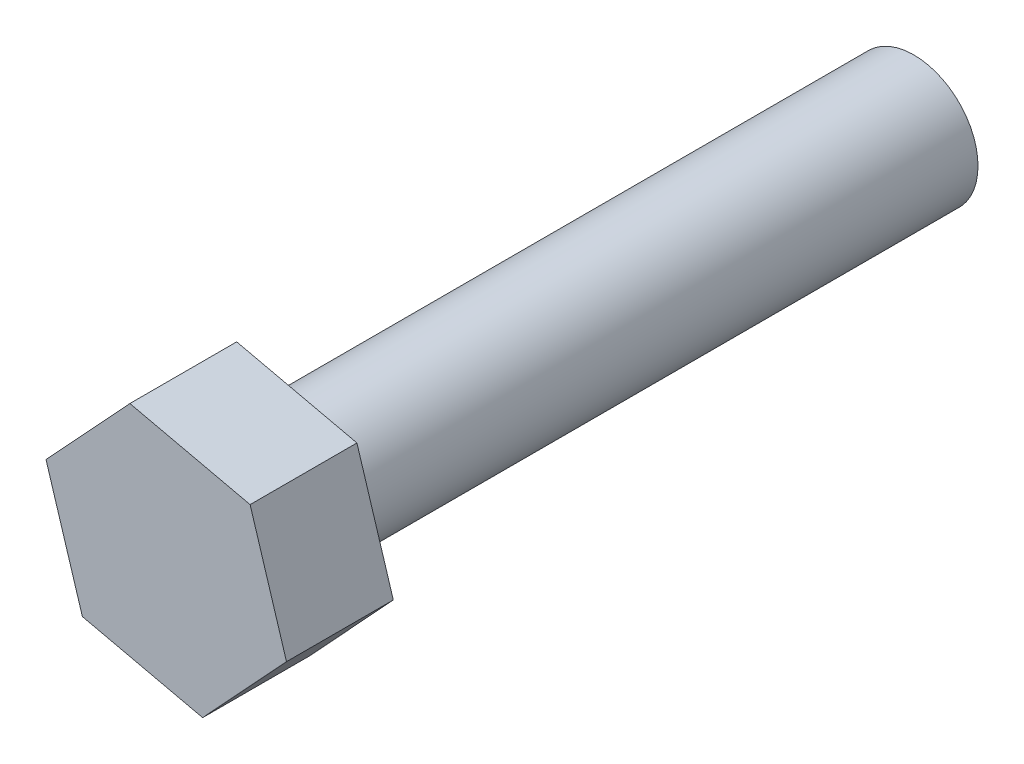
ISO-10303-21;
HEADER;
FILE_DESCRIPTION(('STEP AP214'),'2;1');
FILE_NAME('part.step','',(''),(''),'','','');
FILE_SCHEMA(('AUTOMOTIVE_DESIGN { 1 0 10303 214 1 1 1 1 }'));
ENDSEC;
DATA;
#1=APPLICATION_CONTEXT('core data for automotive mechanical design processes');
#2=APPLICATION_PROTOCOL_DEFINITION('international standard','automotive_design',2000,#1);
#3=PRODUCT_CONTEXT('',#1,'mechanical');
#4=PRODUCT('Part','Part','',(#3));
#5=PRODUCT_RELATED_PRODUCT_CATEGORY('part','',(#4));
#6=PRODUCT_DEFINITION_FORMATION('','',#4);
#7=PRODUCT_DEFINITION_CONTEXT('part definition',#1,'design');
#8=PRODUCT_DEFINITION('design','',#6,#7);
#9=PRODUCT_DEFINITION_SHAPE('','',#8);
#10=(LENGTH_UNIT() NAMED_UNIT(*) SI_UNIT(.MILLI.,.METRE.));
#11=(NAMED_UNIT(*) PLANE_ANGLE_UNIT() SI_UNIT($,.RADIAN.));
#12=(NAMED_UNIT(*) SI_UNIT($,.STERADIAN.) SOLID_ANGLE_UNIT());
#13=UNCERTAINTY_MEASURE_WITH_UNIT(LENGTH_MEASURE(1.E-05),#10,'distance_accuracy_value','');
#14=(GEOMETRIC_REPRESENTATION_CONTEXT(3) GLOBAL_UNCERTAINTY_ASSIGNED_CONTEXT((#13)) GLOBAL_UNIT_ASSIGNED_CONTEXT((#10,
#11,#12)) REPRESENTATION_CONTEXT('',''));
#15=CARTESIAN_POINT('',(0.,0.,0.));
#16=DIRECTION('',(0.,0.,1.));
#17=DIRECTION('',(1.,0.,0.));
#18=AXIS2_PLACEMENT_3D('',#15,#16,#17);
#19=CARTESIAN_POINT('',(0.,0.,30.));
#20=DIRECTION('',(0.,0.,-1.));
#21=DIRECTION('',(-1.,0.,0.));
#22=AXIS2_PLACEMENT_3D('',#19,#20,#21);
#23=CYLINDRICAL_SURFACE('',#22,3.);
#24=CARTESIAN_POINT('',(0.,0.,30.));
#25=DIRECTION('',(0.,0.,1.));
#26=DIRECTION('',(1.,0.,0.));
#27=AXIS2_PLACEMENT_3D('',#24,#25,#26);
#28=CIRCLE('',#27,3.);
#29=CARTESIAN_POINT('',(3.,0.,30.));
#30=VERTEX_POINT('',#29);
#31=EDGE_CURVE('E11',#30,#30,#28,.T.);
#32=ORIENTED_EDGE('',*,*,#31,.F.);
#33=EDGE_LOOP('',(#32));
#34=FACE_BOUND('',#33,.T.);
#35=CARTESIAN_POINT('',(0.,0.,0.));
#36=DIRECTION('',(0.,0.,1.));
#37=DIRECTION('',(1.,0.,0.));
#38=AXIS2_PLACEMENT_3D('',#35,#36,#37);
#39=CIRCLE('',#38,3.);
#40=CARTESIAN_POINT('',(3.,0.,0.));
#41=VERTEX_POINT('',#40);
#42=EDGE_CURVE('E42',#41,#41,#39,.T.);
#43=ORIENTED_EDGE('',*,*,#42,.T.);
#44=EDGE_LOOP('',(#43));
#45=FACE_BOUND('',#44,.T.);
#46=ADVANCED_FACE('F39',(#34,#45),#23,.T.);
#47=CARTESIAN_POINT('',(0.,0.,0.));
#48=DIRECTION('',(0.,0.,1.));
#49=DIRECTION('',(1.,0.,0.));
#50=AXIS2_PLACEMENT_3D('',#47,#48,#49);
#51=PLANE('',#50);
#52=ORIENTED_EDGE('',*,*,#42,.F.);
#53=EDGE_LOOP('',(#52));
#54=FACE_BOUND('',#53,.T.);
#55=ADVANCED_FACE('F164',(#54),#51,.F.);
#56=CARTESIAN_POINT('',(5.62906469185798,-1.28334096334963,35.));
#57=DIRECTION('',(-0.955500291376495,-0.294990157767058,0.));
#58=DIRECTION('',(0.294990157767058,-0.955500291376495,0.));
#59=AXIS2_PLACEMENT_3D('',#56,#57,#58);
#60=PLANE('',#59);
#61=DIRECTION('',(-0.294990157767058,0.955500291376495,0.));
#62=VECTOR('',#61,1.);
#63=CARTESIAN_POINT('',(5.62906469185798,-1.28334096334963,30.));
#64=LINE('',#63,#62);
#65=CARTESIAN_POINT('',(5.62906469185798,-1.28334096334963,30.));
#66=VERTEX_POINT('',#65);
#67=CARTESIAN_POINT('',(3.92593822190697,4.23324254102022,30.));
#68=VERTEX_POINT('',#67);
#69=EDGE_CURVE('E129',#66,#68,#64,.T.);
#70=ORIENTED_EDGE('',*,*,#69,.T.);
#71=DIRECTION('',(0.,0.,-1.));
#72=VECTOR('',#71,1.);
#73=CARTESIAN_POINT('',(3.92593822190697,4.23324254102022,35.));
#74=LINE('',#73,#72);
#75=CARTESIAN_POINT('',(3.92593822190697,4.23324254102022,35.));
#76=VERTEX_POINT('',#75);
#77=EDGE_CURVE('E156',#76,#68,#74,.T.);
#78=ORIENTED_EDGE('',*,*,#77,.F.);
#79=DIRECTION('',(-0.294990157767058,0.955500291376495,0.));
#80=VECTOR('',#79,1.);
#81=CARTESIAN_POINT('',(5.62906469185798,-1.28334096334963,35.));
#82=LINE('',#81,#80);
#83=CARTESIAN_POINT('',(5.62906469185798,-1.28334096334963,35.));
#84=VERTEX_POINT('',#83);
#85=EDGE_CURVE('E145',#84,#76,#82,.T.);
#86=ORIENTED_EDGE('',*,*,#85,.F.);
#87=DIRECTION('',(0.,0.,-1.));
#88=VECTOR('',#87,1.);
#89=CARTESIAN_POINT('',(5.62906469185798,-1.28334096334963,35.));
#90=LINE('',#89,#88);
#91=EDGE_CURVE('E125',#84,#66,#90,.T.);
#92=ORIENTED_EDGE('',*,*,#91,.T.);
#93=EDGE_LOOP('',(#70,#78,#86,#92));
#94=FACE_BOUND('',#93,.T.);
#95=ADVANCED_FACE('F166',(#94),#60,.F.);
#96=CARTESIAN_POINT('',(3.92593822190697,4.23324254102022,35.));
#97=DIRECTION('',(-0.222281175195596,-0.974982604539007,0.));
#98=DIRECTION('',(0.974982604539007,-0.222281175195596,0.));
#99=AXIS2_PLACEMENT_3D('',#96,#97,#98);
#100=PLANE('',#99);
#101=DIRECTION('',(-0.974982604539006,0.222281175195595,0.));
#102=VECTOR('',#101,1.);
#103=CARTESIAN_POINT('',(3.92593822190697,4.23324254102022,30.));
#104=LINE('',#103,#102);
#105=CARTESIAN_POINT('',(-1.70312646995101,5.51658350436985,30.));
#106=VERTEX_POINT('',#105);
#107=EDGE_CURVE('E133',#68,#106,#104,.T.);
#108=ORIENTED_EDGE('',*,*,#107,.T.);
#109=DIRECTION('',(0.,0.,-1.));
#110=VECTOR('',#109,1.);
#111=CARTESIAN_POINT('',(-1.70312646995101,5.51658350436985,35.));
#112=LINE('',#111,#110);
#113=CARTESIAN_POINT('',(-1.70312646995101,5.51658350436985,35.));
#114=VERTEX_POINT('',#113);
#115=EDGE_CURVE('E152',#114,#106,#112,.T.);
#116=ORIENTED_EDGE('',*,*,#115,.F.);
#117=DIRECTION('',(-0.974982604539006,0.222281175195595,0.));
#118=VECTOR('',#117,1.);
#119=CARTESIAN_POINT('',(3.92593822190697,4.23324254102022,35.));
#120=LINE('',#119,#118);
#121=EDGE_CURVE('E94',#76,#114,#120,.T.);
#122=ORIENTED_EDGE('',*,*,#121,.F.);
#123=ORIENTED_EDGE('',*,*,#77,.T.);
#124=EDGE_LOOP('',(#108,#116,#122,#123));
#125=FACE_BOUND('',#124,.T.);
#126=ADVANCED_FACE('F171',(#125),#100,.F.);
#127=CARTESIAN_POINT('',(-1.70312646995101,5.51658350436985,35.));
#128=DIRECTION('',(0.733219116180899,-0.679992446771948,0.));
#129=DIRECTION('',(0.679992446771948,0.733219116180899,0.));
#130=AXIS2_PLACEMENT_3D('',#127,#128,#129);
#131=PLANE('',#130);
#132=DIRECTION('',(-0.679992446771948,-0.733219116180899,0.));
#133=VECTOR('',#132,1.);
#134=CARTESIAN_POINT('',(-1.70312646995101,5.51658350436985,30.));
#135=LINE('',#134,#133);
#136=CARTESIAN_POINT('',(-5.62906469185798,1.28334096334963,30.));
#137=VERTEX_POINT('',#136);
#138=EDGE_CURVE('E136',#106,#137,#135,.T.);
#139=ORIENTED_EDGE('',*,*,#138,.T.);
#140=DIRECTION('',(0.,0.,-1.));
#141=VECTOR('',#140,1.);
#142=CARTESIAN_POINT('',(-5.62906469185798,1.28334096334963,35.));
#143=LINE('',#142,#141);
#144=CARTESIAN_POINT('',(-5.62906469185798,1.28334096334963,35.));
#145=VERTEX_POINT('',#144);
#146=EDGE_CURVE('E118',#145,#137,#143,.T.);
#147=ORIENTED_EDGE('',*,*,#146,.F.);
#148=DIRECTION('',(-0.679992446771948,-0.733219116180899,0.));
#149=VECTOR('',#148,1.);
#150=CARTESIAN_POINT('',(-1.70312646995101,5.51658350436985,35.));
#151=LINE('',#150,#149);
#152=EDGE_CURVE('E107',#114,#145,#151,.T.);
#153=ORIENTED_EDGE('',*,*,#152,.F.);
#154=ORIENTED_EDGE('',*,*,#115,.T.);
#155=EDGE_LOOP('',(#139,#147,#153,#154));
#156=FACE_BOUND('',#155,.T.);
#157=ADVANCED_FACE('F178',(#156),#131,.F.);
#158=CARTESIAN_POINT('',(-5.62906469185798,1.28334096334963,35.));
#159=DIRECTION('',(0.955500291376495,0.294990157767058,0.));
#160=DIRECTION('',(-0.294990157767058,0.955500291376495,0.));
#161=AXIS2_PLACEMENT_3D('',#158,#159,#160);
#162=PLANE('',#161);
#163=DIRECTION('',(0.294990157767058,-0.955500291376495,0.));
#164=VECTOR('',#163,1.);
#165=CARTESIAN_POINT('',(-5.62906469185798,1.28334096334963,30.));
#166=LINE('',#165,#164);
#167=CARTESIAN_POINT('',(-3.92593822190697,-4.23324254102022,30.));
#168=VERTEX_POINT('',#167);
#169=EDGE_CURVE('E116',#137,#168,#166,.T.);
#170=ORIENTED_EDGE('',*,*,#169,.T.);
#171=DIRECTION('',(0.,0.,-1.));
#172=VECTOR('',#171,1.);
#173=CARTESIAN_POINT('',(-3.92593822190697,-4.23324254102022,35.));
#174=LINE('',#173,#172);
#175=CARTESIAN_POINT('',(-3.92593822190697,-4.23324254102022,35.));
#176=VERTEX_POINT('',#175);
#177=EDGE_CURVE('E113',#176,#168,#174,.T.);
#178=ORIENTED_EDGE('',*,*,#177,.F.);
#179=DIRECTION('',(0.294990157767058,-0.955500291376495,0.));
#180=VECTOR('',#179,1.);
#181=CARTESIAN_POINT('',(-5.62906469185798,1.28334096334963,35.));
#182=LINE('',#181,#180);
#183=EDGE_CURVE('E101',#145,#176,#182,.T.);
#184=ORIENTED_EDGE('',*,*,#183,.F.);
#185=ORIENTED_EDGE('',*,*,#146,.T.);
#186=EDGE_LOOP('',(#170,#178,#184,#185));
#187=FACE_BOUND('',#186,.T.);
#188=ADVANCED_FACE('F114',(#187),#162,.F.);
#189=CARTESIAN_POINT('',(-3.92593822190697,-4.23324254102022,35.));
#190=DIRECTION('',(0.222281175195596,0.974982604539007,0.));
#191=DIRECTION('',(-0.974982604539007,0.222281175195596,0.));
#192=AXIS2_PLACEMENT_3D('',#189,#190,#191);
#193=PLANE('',#192);
#194=DIRECTION('',(0.974982604539006,-0.222281175195595,0.));
#195=VECTOR('',#194,1.);
#196=CARTESIAN_POINT('',(-3.92593822190697,-4.23324254102022,30.));
#197=LINE('',#196,#195);
#198=CARTESIAN_POINT('',(1.70312646995101,-5.51658350436985,30.));
#199=VERTEX_POINT('',#198);
#200=EDGE_CURVE('E79',#168,#199,#197,.T.);
#201=ORIENTED_EDGE('',*,*,#200,.T.);
#202=DIRECTION('',(0.,0.,-1.));
#203=VECTOR('',#202,1.);
#204=CARTESIAN_POINT('',(1.70312646995101,-5.51658350436985,35.));
#205=LINE('',#204,#203);
#206=CARTESIAN_POINT('',(1.70312646995101,-5.51658350436985,35.));
#207=VERTEX_POINT('',#206);
#208=EDGE_CURVE('E119',#207,#199,#205,.T.);
#209=ORIENTED_EDGE('',*,*,#208,.F.);
#210=DIRECTION('',(0.974982604539006,-0.222281175195595,0.));
#211=VECTOR('',#210,1.);
#212=CARTESIAN_POINT('',(-3.92593822190697,-4.23324254102022,35.));
#213=LINE('',#212,#211);
#214=EDGE_CURVE('E105',#176,#207,#213,.T.);
#215=ORIENTED_EDGE('',*,*,#214,.F.);
#216=ORIENTED_EDGE('',*,*,#177,.T.);
#217=EDGE_LOOP('',(#201,#209,#215,#216));
#218=FACE_BOUND('',#217,.T.);
#219=ADVANCED_FACE('F121',(#218),#193,.F.);
#220=CARTESIAN_POINT('',(1.70312646995101,-5.51658350436985,35.));
#221=DIRECTION('',(-0.733219116180899,0.679992446771948,0.));
#222=DIRECTION('',(-0.679992446771948,-0.733219116180899,0.));
#223=AXIS2_PLACEMENT_3D('',#220,#221,#222);
#224=PLANE('',#223);
#225=DIRECTION('',(0.679992446771948,0.733219116180899,0.));
#226=VECTOR('',#225,1.);
#227=CARTESIAN_POINT('',(1.70312646995101,-5.51658350436985,30.));
#228=LINE('',#227,#226);
#229=EDGE_CURVE('E85',#199,#66,#228,.T.);
#230=ORIENTED_EDGE('',*,*,#229,.T.);
#231=ORIENTED_EDGE('',*,*,#91,.F.);
#232=DIRECTION('',(0.679992446771948,0.733219116180899,0.));
#233=VECTOR('',#232,1.);
#234=CARTESIAN_POINT('',(1.70312646995101,-5.51658350436985,35.));
#235=LINE('',#234,#233);
#236=EDGE_CURVE('E56',#207,#84,#235,.T.);
#237=ORIENTED_EDGE('',*,*,#236,.F.);
#238=ORIENTED_EDGE('',*,*,#208,.T.);
#239=EDGE_LOOP('',(#230,#231,#237,#238));
#240=FACE_BOUND('',#239,.T.);
#241=ADVANCED_FACE('F186',(#240),#224,.F.);
#242=CARTESIAN_POINT('',(0.,0.,35.));
#243=DIRECTION('',(0.,0.,1.));
#244=DIRECTION('',(1.,0.,0.));
#245=AXIS2_PLACEMENT_3D('',#242,#243,#244);
#246=PLANE('',#245);
#247=ORIENTED_EDGE('',*,*,#85,.T.);
#248=ORIENTED_EDGE('',*,*,#121,.T.);
#249=ORIENTED_EDGE('',*,*,#152,.T.);
#250=ORIENTED_EDGE('',*,*,#183,.T.);
#251=ORIENTED_EDGE('',*,*,#214,.T.);
#252=ORIENTED_EDGE('',*,*,#236,.T.);
#253=EDGE_LOOP('',(#247,#248,#249,#250,#251,#252));
#254=FACE_BOUND('',#253,.T.);
#255=ADVANCED_FACE('F103',(#254),#246,.T.);
#256=CARTESIAN_POINT('',(0.,0.,30.));
#257=DIRECTION('',(0.,0.,1.));
#258=DIRECTION('',(1.,0.,0.));
#259=AXIS2_PLACEMENT_3D('',#256,#257,#258);
#260=PLANE('',#259);
#261=ORIENTED_EDGE('',*,*,#31,.T.);
#262=EDGE_LOOP('',(#261));
#263=FACE_BOUND('',#262,.T.);
#264=ORIENTED_EDGE('',*,*,#69,.F.);
#265=ORIENTED_EDGE('',*,*,#229,.F.);
#266=ORIENTED_EDGE('',*,*,#200,.F.);
#267=ORIENTED_EDGE('',*,*,#169,.F.);
#268=ORIENTED_EDGE('',*,*,#138,.F.);
#269=ORIENTED_EDGE('',*,*,#107,.F.);
#270=EDGE_LOOP('',(#264,#265,#266,#267,#268,#269));
#271=FACE_BOUND('',#270,.T.);
#272=ADVANCED_FACE('F189',(#263,#271),#260,.F.);
#273=CLOSED_SHELL('',(#46,#55,#95,#126,#157,#188,#219,#241,#255,#272));
#274=MANIFOLD_SOLID_BREP('B2',#273);
#275=ADVANCED_BREP_SHAPE_REPRESENTATION('',(#18,#274),#14);
#276=SHAPE_DEFINITION_REPRESENTATION(#9,#275);
ENDSEC;
END-ISO-10303-21;
